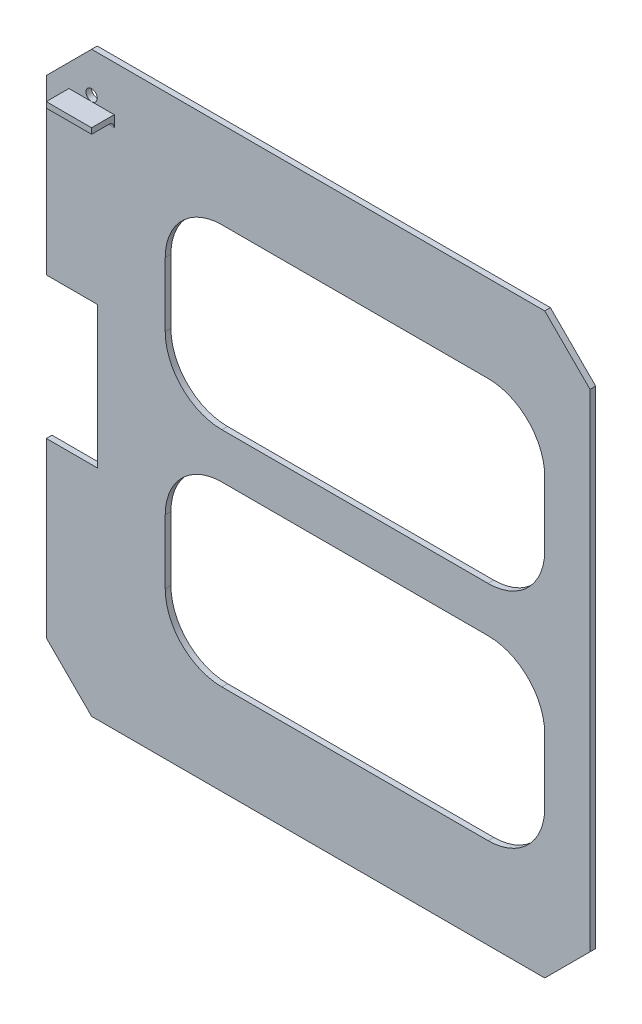
ISO-10303-21;
HEADER;
FILE_DESCRIPTION(('STEP AP214'),'2;1');
FILE_NAME('part.step','',(''),(''),'','','');
FILE_SCHEMA(('AUTOMOTIVE_DESIGN { 1 0 10303 214 1 1 1 1 }'));
ENDSEC;
DATA;
#1=APPLICATION_CONTEXT('core data for automotive mechanical design processes');
#2=APPLICATION_PROTOCOL_DEFINITION('international standard','automotive_design',2000,#1);
#3=PRODUCT_CONTEXT('',#1,'mechanical');
#4=PRODUCT('Part','Part','',(#3));
#5=PRODUCT_RELATED_PRODUCT_CATEGORY('part','',(#4));
#6=PRODUCT_DEFINITION_FORMATION('','',#4);
#7=PRODUCT_DEFINITION_CONTEXT('part definition',#1,'design');
#8=PRODUCT_DEFINITION('design','',#6,#7);
#9=PRODUCT_DEFINITION_SHAPE('','',#8);
#10=(LENGTH_UNIT() NAMED_UNIT(*) SI_UNIT(.MILLI.,.METRE.));
#11=(NAMED_UNIT(*) PLANE_ANGLE_UNIT() SI_UNIT($,.RADIAN.));
#12=(NAMED_UNIT(*) SI_UNIT($,.STERADIAN.) SOLID_ANGLE_UNIT());
#13=UNCERTAINTY_MEASURE_WITH_UNIT(LENGTH_MEASURE(1.E-05),#10,'distance_accuracy_value','');
#14=(GEOMETRIC_REPRESENTATION_CONTEXT(3) GLOBAL_UNCERTAINTY_ASSIGNED_CONTEXT((#13)) GLOBAL_UNIT_ASSIGNED_CONTEXT((#10,
#11,#12)) REPRESENTATION_CONTEXT('',''));
#15=CARTESIAN_POINT('',(0.,0.,0.));
#16=DIRECTION('',(0.,0.,1.));
#17=DIRECTION('',(1.,0.,0.));
#18=AXIS2_PLACEMENT_3D('',#15,#16,#17);
#19=CARTESIAN_POINT('',(0.,25.4,3.175));
#20=DIRECTION('',(1.,0.,0.));
#21=DIRECTION('',(0.,0.,-1.));
#22=AXIS2_PLACEMENT_3D('',#19,#20,#21);
#23=PLANE('',#22);
#24=DIRECTION('',(0.,-1.,0.));
#25=VECTOR('',#24,1.);
#26=CARTESIAN_POINT('',(0.,25.4,0.));
#27=LINE('',#26,#25);
#28=CARTESIAN_POINT('',(0.,298.45,0.));
#29=VERTEX_POINT('',#28);
#30=CARTESIAN_POINT('',(0.,201.6125,0.));
#31=VERTEX_POINT('',#30);
#32=EDGE_CURVE('E465',#29,#31,#27,.T.);
#33=ORIENTED_EDGE('',*,*,#32,.T.);
#34=DIRECTION('',(0.,0.,1.));
#35=VECTOR('',#34,1.);
#36=CARTESIAN_POINT('',(0.,201.6125,0.));
#37=LINE('',#36,#35);
#38=CARTESIAN_POINT('',(0.,201.6125,3.175));
#39=VERTEX_POINT('',#38);
#40=EDGE_CURVE('E430',#31,#39,#37,.T.);
#41=ORIENTED_EDGE('',*,*,#40,.T.);
#42=DIRECTION('',(0.,-1.,0.));
#43=VECTOR('',#42,1.);
#44=CARTESIAN_POINT('',(0.,25.4,3.175));
#45=LINE('',#44,#43);
#46=CARTESIAN_POINT('',(0.,298.45,3.175));
#47=VERTEX_POINT('',#46);
#48=EDGE_CURVE('E446',#47,#39,#45,.T.);
#49=ORIENTED_EDGE('',*,*,#48,.F.);
#50=DIRECTION('',(0.,0.,-1.));
#51=VECTOR('',#50,1.);
#52=CARTESIAN_POINT('',(0.,298.45,3.175));
#53=LINE('',#52,#51);
#54=EDGE_CURVE('E494',#47,#29,#53,.T.);
#55=ORIENTED_EDGE('',*,*,#54,.T.);
#56=EDGE_LOOP('',(#33,#41,#49,#55));
#57=FACE_BOUND('',#56,.T.);
#58=ADVANCED_FACE('F33',(#57),#23,.F.);
#59=CARTESIAN_POINT('',(25.4,323.85,3.175));
#60=DIRECTION('',(0.,-1.,0.));
#61=DIRECTION('',(0.,0.,-1.));
#62=AXIS2_PLACEMENT_3D('',#59,#60,#61);
#63=PLANE('',#62);
#64=DIRECTION('',(-1.,0.,0.));
#65=VECTOR('',#64,1.);
#66=CARTESIAN_POINT('',(25.4,323.85,0.));
#67=LINE('',#66,#65);
#68=CARTESIAN_POINT('',(279.4,323.85,0.));
#69=VERTEX_POINT('',#68);
#70=CARTESIAN_POINT('',(25.4,323.85,0.));
#71=VERTEX_POINT('',#70);
#72=EDGE_CURVE('E433',#69,#71,#67,.T.);
#73=ORIENTED_EDGE('',*,*,#72,.T.);
#74=DIRECTION('',(0.,0.,-1.));
#75=VECTOR('',#74,1.);
#76=CARTESIAN_POINT('',(25.4,323.85,3.175));
#77=LINE('',#76,#75);
#78=CARTESIAN_POINT('',(25.4,323.85,3.175));
#79=VERTEX_POINT('',#78);
#80=EDGE_CURVE('E497',#79,#71,#77,.T.);
#81=ORIENTED_EDGE('',*,*,#80,.F.);
#82=DIRECTION('',(-1.,0.,0.));
#83=VECTOR('',#82,1.);
#84=CARTESIAN_POINT('',(25.4,323.85,3.175));
#85=LINE('',#84,#83);
#86=CARTESIAN_POINT('',(279.4,323.85,3.175));
#87=VERTEX_POINT('',#86);
#88=EDGE_CURVE('E439',#87,#79,#85,.T.);
#89=ORIENTED_EDGE('',*,*,#88,.F.);
#90=DIRECTION('',(0.,0.,-1.));
#91=VECTOR('',#90,1.);
#92=CARTESIAN_POINT('',(279.4,323.85,3.175));
#93=LINE('',#92,#91);
#94=EDGE_CURVE('E459',#87,#69,#93,.T.);
#95=ORIENTED_EDGE('',*,*,#94,.T.);
#96=EDGE_LOOP('',(#73,#81,#89,#95));
#97=FACE_BOUND('',#96,.T.);
#98=ADVANCED_FACE('F541',(#97),#63,.F.);
#99=CARTESIAN_POINT('',(0.,298.45,3.175));
#100=DIRECTION('',(0.707106781186547,-0.707106781186548,0.));
#101=DIRECTION('',(0.707106781186548,0.707106781186547,0.));
#102=AXIS2_PLACEMENT_3D('',#99,#100,#101);
#103=PLANE('',#102);
#104=DIRECTION('',(-0.707106781186548,-0.707106781186547,0.));
#105=VECTOR('',#104,1.);
#106=CARTESIAN_POINT('',(0.,298.45,0.));
#107=LINE('',#106,#105);
#108=EDGE_CURVE('E462',#71,#29,#107,.T.);
#109=ORIENTED_EDGE('',*,*,#108,.T.);
#110=ORIENTED_EDGE('',*,*,#54,.F.);
#111=DIRECTION('',(-0.707106781186548,-0.707106781186547,0.));
#112=VECTOR('',#111,1.);
#113=CARTESIAN_POINT('',(0.,298.45,3.175));
#114=LINE('',#113,#112);
#115=EDGE_CURVE('E442',#79,#47,#114,.T.);
#116=ORIENTED_EDGE('',*,*,#115,.F.);
#117=ORIENTED_EDGE('',*,*,#80,.T.);
#118=EDGE_LOOP('',(#109,#110,#116,#117));
#119=FACE_BOUND('',#118,.T.);
#120=ADVANCED_FACE('F548',(#119),#103,.F.);
#121=CARTESIAN_POINT('',(0.,122.2375,3.175));
#122=VERTEX_POINT('',#121);
#123=CARTESIAN_POINT('',(0.,25.4,3.175));
#124=VERTEX_POINT('',#123);
#125=EDGE_CURVE('E445',#122,#124,#45,.T.);
#126=ORIENTED_EDGE('',*,*,#125,.F.);
#127=DIRECTION('',(0.,0.,1.));
#128=VECTOR('',#127,1.);
#129=CARTESIAN_POINT('',(0.,122.2375,0.));
#130=LINE('',#129,#128);
#131=CARTESIAN_POINT('',(0.,122.2375,0.));
#132=VERTEX_POINT('',#131);
#133=EDGE_CURVE('E423',#132,#122,#130,.T.);
#134=ORIENTED_EDGE('',*,*,#133,.F.);
#135=CARTESIAN_POINT('',(0.,25.4,0.));
#136=VERTEX_POINT('',#135);
#137=EDGE_CURVE('E464',#132,#136,#27,.T.);
#138=ORIENTED_EDGE('',*,*,#137,.T.);
#139=DIRECTION('',(0.,0.,-1.));
#140=VECTOR('',#139,1.);
#141=CARTESIAN_POINT('',(0.,25.4,3.175));
#142=LINE('',#141,#140);
#143=EDGE_CURVE('E491',#124,#136,#142,.T.);
#144=ORIENTED_EDGE('',*,*,#143,.F.);
#145=EDGE_LOOP('',(#126,#134,#138,#144));
#146=FACE_BOUND('',#145,.T.);
#147=ADVANCED_FACE('F544',(#146),#23,.F.);
#148=CARTESIAN_POINT('',(25.4,0.,3.175));
#149=DIRECTION('',(0.707106781186548,0.707106781186548,0.));
#150=DIRECTION('',(-0.707106781186548,0.707106781186548,0.));
#151=AXIS2_PLACEMENT_3D('',#148,#149,#150);
#152=PLANE('',#151);
#153=DIRECTION('',(0.707106781186547,-0.707106781186547,0.));
#154=VECTOR('',#153,1.);
#155=CARTESIAN_POINT('',(25.4,0.,0.));
#156=LINE('',#155,#154);
#157=CARTESIAN_POINT('',(25.4,0.,0.));
#158=VERTEX_POINT('',#157);
#159=EDGE_CURVE('E468',#136,#158,#156,.T.);
#160=ORIENTED_EDGE('',*,*,#159,.T.);
#161=DIRECTION('',(0.,0.,-1.));
#162=VECTOR('',#161,1.);
#163=CARTESIAN_POINT('',(25.4,0.,3.175));
#164=LINE('',#163,#162);
#165=CARTESIAN_POINT('',(25.4,0.,3.175));
#166=VERTEX_POINT('',#165);
#167=EDGE_CURVE('E488',#166,#158,#164,.T.);
#168=ORIENTED_EDGE('',*,*,#167,.F.);
#169=DIRECTION('',(0.707106781186547,-0.707106781186547,0.));
#170=VECTOR('',#169,1.);
#171=CARTESIAN_POINT('',(25.4,0.,3.175));
#172=LINE('',#171,#170);
#173=EDGE_CURVE('E449',#124,#166,#172,.T.);
#174=ORIENTED_EDGE('',*,*,#173,.F.);
#175=ORIENTED_EDGE('',*,*,#143,.T.);
#176=EDGE_LOOP('',(#160,#168,#174,#175));
#177=FACE_BOUND('',#176,.T.);
#178=ADVANCED_FACE('F553',(#177),#152,.F.);
#179=CARTESIAN_POINT('',(25.4,0.,3.175));
#180=DIRECTION('',(0.,1.,0.));
#181=DIRECTION('',(0.,0.,1.));
#182=AXIS2_PLACEMENT_3D('',#179,#180,#181);
#183=PLANE('',#182);
#184=DIRECTION('',(1.,0.,0.));
#185=VECTOR('',#184,1.);
#186=CARTESIAN_POINT('',(25.4,0.,0.));
#187=LINE('',#186,#185);
#188=CARTESIAN_POINT('',(279.4,0.,0.));
#189=VERTEX_POINT('',#188);
#190=EDGE_CURVE('E470',#158,#189,#187,.T.);
#191=ORIENTED_EDGE('',*,*,#190,.T.);
#192=DIRECTION('',(0.,0.,-1.));
#193=VECTOR('',#192,1.);
#194=CARTESIAN_POINT('',(279.4,0.,3.175));
#195=LINE('',#194,#193);
#196=CARTESIAN_POINT('',(279.4,0.,3.175));
#197=VERTEX_POINT('',#196);
#198=EDGE_CURVE('E485',#197,#189,#195,.T.);
#199=ORIENTED_EDGE('',*,*,#198,.F.);
#200=DIRECTION('',(1.,0.,0.));
#201=VECTOR('',#200,1.);
#202=CARTESIAN_POINT('',(25.4,0.,3.175));
#203=LINE('',#202,#201);
#204=EDGE_CURVE('E451',#166,#197,#203,.T.);
#205=ORIENTED_EDGE('',*,*,#204,.F.);
#206=ORIENTED_EDGE('',*,*,#167,.T.);
#207=EDGE_LOOP('',(#191,#199,#205,#206));
#208=FACE_BOUND('',#207,.T.);
#209=ADVANCED_FACE('F559',(#208),#183,.F.);
#210=CARTESIAN_POINT('',(279.4,0.,3.175));
#211=DIRECTION('',(-0.707106781186548,0.707106781186547,0.));
#212=DIRECTION('',(-0.707106781186547,-0.707106781186548,0.));
#213=AXIS2_PLACEMENT_3D('',#210,#211,#212);
#214=PLANE('',#213);
#215=DIRECTION('',(0.707106781186547,0.707106781186548,0.));
#216=VECTOR('',#215,1.);
#217=CARTESIAN_POINT('',(279.4,0.,0.));
#218=LINE('',#217,#216);
#219=CARTESIAN_POINT('',(304.8,25.4,0.));
#220=VERTEX_POINT('',#219);
#221=EDGE_CURVE('E472',#189,#220,#218,.T.);
#222=ORIENTED_EDGE('',*,*,#221,.T.);
#223=DIRECTION('',(0.,0.,-1.));
#224=VECTOR('',#223,1.);
#225=CARTESIAN_POINT('',(304.8,25.4,3.175));
#226=LINE('',#225,#224);
#227=CARTESIAN_POINT('',(304.8,25.4,3.175));
#228=VERTEX_POINT('',#227);
#229=EDGE_CURVE('E482',#228,#220,#226,.T.);
#230=ORIENTED_EDGE('',*,*,#229,.F.);
#231=DIRECTION('',(0.707106781186547,0.707106781186548,0.));
#232=VECTOR('',#231,1.);
#233=CARTESIAN_POINT('',(279.4,0.,3.175));
#234=LINE('',#233,#232);
#235=EDGE_CURVE('E453',#197,#228,#234,.T.);
#236=ORIENTED_EDGE('',*,*,#235,.F.);
#237=ORIENTED_EDGE('',*,*,#198,.T.);
#238=EDGE_LOOP('',(#222,#230,#236,#237));
#239=FACE_BOUND('',#238,.T.);
#240=ADVANCED_FACE('F587',(#239),#214,.F.);
#241=CARTESIAN_POINT('',(304.8,25.4,3.175));
#242=DIRECTION('',(-1.,0.,0.));
#243=DIRECTION('',(0.,0.,1.));
#244=AXIS2_PLACEMENT_3D('',#241,#242,#243);
#245=PLANE('',#244);
#246=DIRECTION('',(0.,1.,0.));
#247=VECTOR('',#246,1.);
#248=CARTESIAN_POINT('',(304.8,25.4,0.));
#249=LINE('',#248,#247);
#250=CARTESIAN_POINT('',(304.8,298.45,0.));
#251=VERTEX_POINT('',#250);
#252=EDGE_CURVE('E474',#220,#251,#249,.T.);
#253=ORIENTED_EDGE('',*,*,#252,.T.);
#254=DIRECTION('',(0.,0.,-1.));
#255=VECTOR('',#254,1.);
#256=CARTESIAN_POINT('',(304.8,298.45,3.175));
#257=LINE('',#256,#255);
#258=CARTESIAN_POINT('',(304.8,298.45,3.175));
#259=VERTEX_POINT('',#258);
#260=EDGE_CURVE('E479',#259,#251,#257,.T.);
#261=ORIENTED_EDGE('',*,*,#260,.F.);
#262=DIRECTION('',(0.,1.,0.));
#263=VECTOR('',#262,1.);
#264=CARTESIAN_POINT('',(304.8,25.4,3.175));
#265=LINE('',#264,#263);
#266=EDGE_CURVE('E455',#228,#259,#265,.T.);
#267=ORIENTED_EDGE('',*,*,#266,.F.);
#268=ORIENTED_EDGE('',*,*,#229,.T.);
#269=EDGE_LOOP('',(#253,#261,#267,#268));
#270=FACE_BOUND('',#269,.T.);
#271=ADVANCED_FACE('F591',(#270),#245,.F.);
#272=CARTESIAN_POINT('',(279.4,323.85,3.175));
#273=DIRECTION('',(-0.707106781186548,-0.707106781186548,0.));
#274=DIRECTION('',(0.707106781186548,-0.707106781186548,0.));
#275=AXIS2_PLACEMENT_3D('',#272,#273,#274);
#276=PLANE('',#275);
#277=DIRECTION('',(-0.707106781186547,0.707106781186547,0.));
#278=VECTOR('',#277,1.);
#279=CARTESIAN_POINT('',(279.4,323.85,0.));
#280=LINE('',#279,#278);
#281=EDGE_CURVE('E443',#251,#69,#280,.T.);
#282=ORIENTED_EDGE('',*,*,#281,.T.);
#283=ORIENTED_EDGE('',*,*,#94,.F.);
#284=DIRECTION('',(-0.707106781186547,0.707106781186547,0.));
#285=VECTOR('',#284,1.);
#286=CARTESIAN_POINT('',(279.4,323.85,3.175));
#287=LINE('',#286,#285);
#288=EDGE_CURVE('E457',#259,#87,#287,.T.);
#289=ORIENTED_EDGE('',*,*,#288,.F.);
#290=ORIENTED_EDGE('',*,*,#260,.T.);
#291=EDGE_LOOP('',(#282,#283,#289,#290));
#292=FACE_BOUND('',#291,.T.);
#293=ADVANCED_FACE('F596',(#292),#276,.F.);
#294=CARTESIAN_POINT('',(0.,0.,3.175));
#295=DIRECTION('',(0.,0.,1.));
#296=DIRECTION('',(1.,0.,0.));
#297=AXIS2_PLACEMENT_3D('',#294,#295,#296);
#298=PLANE('',#297);
#299=DIRECTION('',(0.,1.,0.));
#300=VECTOR('',#299,1.);
#301=CARTESIAN_POINT('',(38.1,298.45,3.175));
#302=LINE('',#301,#300);
#303=CARTESIAN_POINT('',(38.1,292.1,3.175));
#304=VERTEX_POINT('',#303);
#305=CARTESIAN_POINT('',(38.1,298.45,3.175));
#306=VERTEX_POINT('',#305);
#307=EDGE_CURVE('E48',#304,#306,#302,.T.);
#308=ORIENTED_EDGE('',*,*,#307,.F.);
#309=DIRECTION('',(1.,0.,0.));
#310=VECTOR('',#309,1.);
#311=CARTESIAN_POINT('',(0.,292.1,3.175));
#312=LINE('',#311,#310);
#313=CARTESIAN_POINT('',(12.7,292.1,3.175));
#314=VERTEX_POINT('',#313);
#315=EDGE_CURVE('E503',#304,#314,#312,.F.);
#316=ORIENTED_EDGE('',*,*,#315,.T.);
#317=DIRECTION('',(0.,-1.,0.));
#318=VECTOR('',#317,1.);
#319=CARTESIAN_POINT('',(12.7,298.45,3.175));
#320=LINE('',#319,#318);
#321=CARTESIAN_POINT('',(12.7,298.45,3.175));
#322=VERTEX_POINT('',#321);
#323=EDGE_CURVE('E55',#322,#314,#320,.T.);
#324=ORIENTED_EDGE('',*,*,#323,.F.);
#325=DIRECTION('',(-1.,0.,0.));
#326=VECTOR('',#325,1.);
#327=CARTESIAN_POINT('',(12.7,298.45,3.175));
#328=LINE('',#327,#326);
#329=CARTESIAN_POINT('',(25.4,298.45,3.175));
#330=VERTEX_POINT('',#329);
#331=EDGE_CURVE('E500',#330,#322,#328,.T.);
#332=ORIENTED_EDGE('',*,*,#331,.F.);
#333=CARTESIAN_POINT('',(25.4,301.625,3.175));
#334=DIRECTION('',(0.,0.,1.));
#335=DIRECTION('',(1.,0.,0.));
#336=AXIS2_PLACEMENT_3D('',#333,#334,#335);
#337=CIRCLE('',#336,3.17499999999998);
#338=EDGE_CURVE('E273',#330,#330,#337,.T.);
#339=ORIENTED_EDGE('',*,*,#338,.F.);
#340=EDGE_CURVE('E269',#306,#330,#328,.T.);
#341=ORIENTED_EDGE('',*,*,#340,.F.);
#342=EDGE_LOOP('',(#308,#316,#324,#332,#339,#341));
#343=FACE_BOUND('',#342,.T.);
#344=CARTESIAN_POINT('',(98.425,207.424891659339,3.175));
#345=DIRECTION('',(0.,0.,1.));
#346=DIRECTION('',(-1.,0.,0.));
#347=AXIS2_PLACEMENT_3D('',#344,#345,#346);
#348=CIRCLE('',#347,31.75);
#349=CARTESIAN_POINT('',(66.675,207.424891659339,3.175));
#350=VERTEX_POINT('',#349);
#351=CARTESIAN_POINT('',(98.4250000000002,175.674891659339,3.175));
#352=VERTEX_POINT('',#351);
#353=EDGE_CURVE('E283',#350,#352,#348,.T.);
#354=ORIENTED_EDGE('',*,*,#353,.F.);
#355=DIRECTION('',(0.,-1.,0.));
#356=VECTOR('',#355,1.);
#357=CARTESIAN_POINT('',(66.675,243.399783318678,3.175));
#358=LINE('',#357,#356);
#359=CARTESIAN_POINT('',(66.675,243.399783318678,3.175));
#360=VERTEX_POINT('',#359);
#361=EDGE_CURVE('E289',#360,#350,#358,.T.);
#362=ORIENTED_EDGE('',*,*,#361,.F.);
#363=CARTESIAN_POINT('',(98.425,243.399783318679,3.175));
#364=DIRECTION('',(0.,0.,1.));
#365=DIRECTION('',(-1.,0.,0.));
#366=AXIS2_PLACEMENT_3D('',#363,#364,#365);
#367=CIRCLE('',#366,31.75);
#368=CARTESIAN_POINT('',(98.4250000000002,275.149783318678,3.175));
#369=VERTEX_POINT('',#368);
#370=EDGE_CURVE('E327',#369,#360,#367,.T.);
#371=ORIENTED_EDGE('',*,*,#370,.F.);
#372=DIRECTION('',(-1.,0.,0.));
#373=VECTOR('',#372,1.);
#374=CARTESIAN_POINT('',(98.4250000000002,275.149783318678,3.175));
#375=LINE('',#374,#373);
#376=CARTESIAN_POINT('',(247.65,275.149783318678,3.175));
#377=VERTEX_POINT('',#376);
#378=EDGE_CURVE('E324',#377,#369,#375,.T.);
#379=ORIENTED_EDGE('',*,*,#378,.F.);
#380=CARTESIAN_POINT('',(247.65,243.399783318679,3.175));
#381=DIRECTION('',(0.,0.,1.));
#382=DIRECTION('',(1.,0.,0.));
#383=AXIS2_PLACEMENT_3D('',#380,#381,#382);
#384=CIRCLE('',#383,31.75);
#385=CARTESIAN_POINT('',(279.4,243.399783318678,3.175));
#386=VERTEX_POINT('',#385);
#387=EDGE_CURVE('E321',#386,#377,#384,.T.);
#388=ORIENTED_EDGE('',*,*,#387,.F.);
#389=DIRECTION('',(0.,1.,0.));
#390=VECTOR('',#389,1.);
#391=CARTESIAN_POINT('',(279.4,243.399783318678,3.175));
#392=LINE('',#391,#390);
#393=CARTESIAN_POINT('',(279.4,207.424891659339,3.175));
#394=VERTEX_POINT('',#393);
#395=EDGE_CURVE('E318',#394,#386,#392,.T.);
#396=ORIENTED_EDGE('',*,*,#395,.F.);
#397=CARTESIAN_POINT('',(247.65,207.424891659339,3.175));
#398=DIRECTION('',(0.,0.,1.));
#399=DIRECTION('',(-1.,0.,0.));
#400=AXIS2_PLACEMENT_3D('',#397,#398,#399);
#401=CIRCLE('',#400,31.75);
#402=CARTESIAN_POINT('',(247.65,175.674891659339,3.175));
#403=VERTEX_POINT('',#402);
#404=EDGE_CURVE('E315',#403,#394,#401,.T.);
#405=ORIENTED_EDGE('',*,*,#404,.F.);
#406=DIRECTION('',(1.,0.,0.));
#407=VECTOR('',#406,1.);
#408=CARTESIAN_POINT('',(98.4250000000002,175.674891659339,3.175));
#409=LINE('',#408,#407);
#410=EDGE_CURVE('E312',#352,#403,#409,.T.);
#411=ORIENTED_EDGE('',*,*,#410,.F.);
#412=EDGE_LOOP('',(#354,#362,#371,#379,#388,#396,#405,#411));
#413=FACE_BOUND('',#412,.T.);
#414=CARTESIAN_POINT('',(98.425,82.55,3.175));
#415=DIRECTION('',(0.,0.,1.));
#416=DIRECTION('',(-1.,0.,0.));
#417=AXIS2_PLACEMENT_3D('',#414,#415,#416);
#418=CIRCLE('',#417,31.75);
#419=CARTESIAN_POINT('',(66.675,82.5500000000002,3.175));
#420=VERTEX_POINT('',#419);
#421=CARTESIAN_POINT('',(98.4250000000002,50.8,3.175));
#422=VERTEX_POINT('',#421);
#423=EDGE_CURVE('E334',#420,#422,#418,.T.);
#424=ORIENTED_EDGE('',*,*,#423,.F.);
#425=DIRECTION('',(0.,-1.,0.));
#426=VECTOR('',#425,1.);
#427=CARTESIAN_POINT('',(66.675,118.524891659339,3.175));
#428=LINE('',#427,#426);
#429=CARTESIAN_POINT('',(66.675,118.524891659339,3.175));
#430=VERTEX_POINT('',#429);
#431=EDGE_CURVE('E353',#430,#420,#428,.T.);
#432=ORIENTED_EDGE('',*,*,#431,.F.);
#433=CARTESIAN_POINT('',(98.425,118.524891659339,3.175));
#434=DIRECTION('',(0.,0.,1.));
#435=DIRECTION('',(-1.,0.,0.));
#436=AXIS2_PLACEMENT_3D('',#433,#434,#435);
#437=CIRCLE('',#436,31.75);
#438=CARTESIAN_POINT('',(98.4250000000003,150.274891659339,3.175));
#439=VERTEX_POINT('',#438);
#440=EDGE_CURVE('E391',#439,#430,#437,.T.);
#441=ORIENTED_EDGE('',*,*,#440,.F.);
#442=DIRECTION('',(-1.,0.,0.));
#443=VECTOR('',#442,1.);
#444=CARTESIAN_POINT('',(98.4250000000003,150.274891659339,3.175));
#445=LINE('',#444,#443);
#446=CARTESIAN_POINT('',(247.65,150.274891659339,3.175));
#447=VERTEX_POINT('',#446);
#448=EDGE_CURVE('E388',#447,#439,#445,.T.);
#449=ORIENTED_EDGE('',*,*,#448,.F.);
#450=CARTESIAN_POINT('',(247.65,118.524891659339,3.175));
#451=DIRECTION('',(0.,0.,1.));
#452=DIRECTION('',(1.,0.,0.));
#453=AXIS2_PLACEMENT_3D('',#450,#451,#452);
#454=CIRCLE('',#453,31.75);
#455=CARTESIAN_POINT('',(279.4,118.524891659339,3.175));
#456=VERTEX_POINT('',#455);
#457=EDGE_CURVE('E385',#456,#447,#454,.T.);
#458=ORIENTED_EDGE('',*,*,#457,.F.);
#459=DIRECTION('',(0.,1.,0.));
#460=VECTOR('',#459,1.);
#461=CARTESIAN_POINT('',(279.4,118.524891659339,3.175));
#462=LINE('',#461,#460);
#463=CARTESIAN_POINT('',(279.4,82.5500000000002,3.175));
#464=VERTEX_POINT('',#463);
#465=EDGE_CURVE('E382',#464,#456,#462,.T.);
#466=ORIENTED_EDGE('',*,*,#465,.F.);
#467=CARTESIAN_POINT('',(247.65,82.55,3.175));
#468=DIRECTION('',(0.,0.,1.));
#469=DIRECTION('',(1.,0.,0.));
#470=AXIS2_PLACEMENT_3D('',#467,#468,#469);
#471=CIRCLE('',#470,31.75);
#472=CARTESIAN_POINT('',(247.65,50.8,3.175));
#473=VERTEX_POINT('',#472);
#474=EDGE_CURVE('E379',#473,#464,#471,.T.);
#475=ORIENTED_EDGE('',*,*,#474,.F.);
#476=DIRECTION('',(1.,0.,0.));
#477=VECTOR('',#476,1.);
#478=CARTESIAN_POINT('',(98.4250000000002,50.8,3.175));
#479=LINE('',#478,#477);
#480=EDGE_CURVE('E376',#422,#473,#479,.T.);
#481=ORIENTED_EDGE('',*,*,#480,.F.);
#482=EDGE_LOOP('',(#424,#432,#441,#449,#458,#466,#475,#481));
#483=FACE_BOUND('',#482,.T.);
#484=DIRECTION('',(-1.,0.,0.));
#485=VECTOR('',#484,1.);
#486=CARTESIAN_POINT('',(0.,201.6125,3.175));
#487=LINE('',#486,#485);
#488=CARTESIAN_POINT('',(28.575,201.6125,3.175));
#489=VERTEX_POINT('',#488);
#490=EDGE_CURVE('E417',#489,#39,#487,.T.);
#491=ORIENTED_EDGE('',*,*,#490,.F.);
#492=DIRECTION('',(0.,1.,0.));
#493=VECTOR('',#492,1.);
#494=CARTESIAN_POINT('',(28.575,201.6125,3.175));
#495=LINE('',#494,#493);
#496=CARTESIAN_POINT('',(28.575,122.2375,3.175));
#497=VERTEX_POINT('',#496);
#498=EDGE_CURVE('E426',#497,#489,#495,.T.);
#499=ORIENTED_EDGE('',*,*,#498,.F.);
#500=DIRECTION('',(1.,0.,0.));
#501=VECTOR('',#500,1.);
#502=CARTESIAN_POINT('',(0.,122.2375,3.175));
#503=LINE('',#502,#501);
#504=EDGE_CURVE('E398',#122,#497,#503,.T.);
#505=ORIENTED_EDGE('',*,*,#504,.F.);
#506=ORIENTED_EDGE('',*,*,#125,.T.);
#507=ORIENTED_EDGE('',*,*,#173,.T.);
#508=ORIENTED_EDGE('',*,*,#204,.T.);
#509=ORIENTED_EDGE('',*,*,#235,.T.);
#510=ORIENTED_EDGE('',*,*,#266,.T.);
#511=ORIENTED_EDGE('',*,*,#288,.T.);
#512=ORIENTED_EDGE('',*,*,#88,.T.);
#513=ORIENTED_EDGE('',*,*,#115,.T.);
#514=ORIENTED_EDGE('',*,*,#48,.T.);
#515=EDGE_LOOP('',(#491,#499,#505,#506,#507,#508,#509,#510,#511,#512,#513,#514));
#516=FACE_BOUND('',#515,.T.);
#517=ADVANCED_FACE('F510',(#343,#413,#483,#516),#298,.T.);
#518=CARTESIAN_POINT('',(0.,0.,0.));
#519=DIRECTION('',(0.,0.,1.));
#520=DIRECTION('',(1.,0.,0.));
#521=AXIS2_PLACEMENT_3D('',#518,#519,#520);
#522=PLANE('',#521);
#523=CARTESIAN_POINT('',(25.4,301.625,0.));
#524=DIRECTION('',(0.,0.,1.));
#525=DIRECTION('',(1.,0.,0.));
#526=AXIS2_PLACEMENT_3D('',#523,#524,#525);
#527=CIRCLE('',#526,3.17499999999998);
#528=CARTESIAN_POINT('',(28.575,301.625,0.));
#529=VERTEX_POINT('',#528);
#530=EDGE_CURVE('E276',#529,#529,#527,.T.);
#531=ORIENTED_EDGE('',*,*,#530,.T.);
#532=EDGE_LOOP('',(#531));
#533=FACE_BOUND('',#532,.T.);
#534=DIRECTION('',(0.,-1.,0.));
#535=VECTOR('',#534,1.);
#536=CARTESIAN_POINT('',(66.675,243.399783318678,0.));
#537=LINE('',#536,#535);
#538=CARTESIAN_POINT('',(66.675,243.399783318678,0.));
#539=VERTEX_POINT('',#538);
#540=CARTESIAN_POINT('',(66.675,207.424891659339,0.));
#541=VERTEX_POINT('',#540);
#542=EDGE_CURVE('E307',#539,#541,#537,.T.);
#543=ORIENTED_EDGE('',*,*,#542,.T.);
#544=CARTESIAN_POINT('',(98.425,207.424891659339,0.));
#545=DIRECTION('',(0.,0.,1.));
#546=DIRECTION('',(-1.,0.,0.));
#547=AXIS2_PLACEMENT_3D('',#544,#545,#546);
#548=CIRCLE('',#547,31.75);
#549=CARTESIAN_POINT('',(98.4250000000002,175.674891659339,0.));
#550=VERTEX_POINT('',#549);
#551=EDGE_CURVE('E285',#541,#550,#548,.T.);
#552=ORIENTED_EDGE('',*,*,#551,.T.);
#553=DIRECTION('',(1.,0.,0.));
#554=VECTOR('',#553,1.);
#555=CARTESIAN_POINT('',(98.4250000000002,175.674891659339,0.));
#556=LINE('',#555,#554);
#557=CARTESIAN_POINT('',(247.65,175.674891659339,0.));
#558=VERTEX_POINT('',#557);
#559=EDGE_CURVE('E288',#550,#558,#556,.T.);
#560=ORIENTED_EDGE('',*,*,#559,.T.);
#561=CARTESIAN_POINT('',(247.65,207.424891659339,0.));
#562=DIRECTION('',(0.,0.,1.));
#563=DIRECTION('',(-1.,0.,0.));
#564=AXIS2_PLACEMENT_3D('',#561,#562,#563);
#565=CIRCLE('',#564,31.75);
#566=CARTESIAN_POINT('',(279.4,207.424891659339,0.));
#567=VERTEX_POINT('',#566);
#568=EDGE_CURVE('E292',#558,#567,#565,.T.);
#569=ORIENTED_EDGE('',*,*,#568,.T.);
#570=DIRECTION('',(0.,1.,0.));
#571=VECTOR('',#570,1.);
#572=CARTESIAN_POINT('',(279.4,243.399783318678,0.));
#573=LINE('',#572,#571);
#574=CARTESIAN_POINT('',(279.4,243.399783318678,0.));
#575=VERTEX_POINT('',#574);
#576=EDGE_CURVE('E295',#567,#575,#573,.T.);
#577=ORIENTED_EDGE('',*,*,#576,.T.);
#578=CARTESIAN_POINT('',(247.65,243.399783318679,0.));
#579=DIRECTION('',(0.,0.,1.));
#580=DIRECTION('',(1.,0.,0.));
#581=AXIS2_PLACEMENT_3D('',#578,#579,#580);
#582=CIRCLE('',#581,31.75);
#583=CARTESIAN_POINT('',(247.65,275.149783318678,0.));
#584=VERTEX_POINT('',#583);
#585=EDGE_CURVE('E298',#575,#584,#582,.T.);
#586=ORIENTED_EDGE('',*,*,#585,.T.);
#587=DIRECTION('',(-1.,0.,0.));
#588=VECTOR('',#587,1.);
#589=CARTESIAN_POINT('',(98.4250000000002,275.149783318678,0.));
#590=LINE('',#589,#588);
#591=CARTESIAN_POINT('',(98.4250000000002,275.149783318678,0.));
#592=VERTEX_POINT('',#591);
#593=EDGE_CURVE('E301',#584,#592,#590,.T.);
#594=ORIENTED_EDGE('',*,*,#593,.T.);
#595=CARTESIAN_POINT('',(98.425,243.399783318679,0.));
#596=DIRECTION('',(0.,0.,1.));
#597=DIRECTION('',(-1.,0.,0.));
#598=AXIS2_PLACEMENT_3D('',#595,#596,#597);
#599=CIRCLE('',#598,31.75);
#600=EDGE_CURVE('E304',#592,#539,#599,.T.);
#601=ORIENTED_EDGE('',*,*,#600,.T.);
#602=EDGE_LOOP('',(#543,#552,#560,#569,#577,#586,#594,#601));
#603=FACE_BOUND('',#602,.T.);
#604=DIRECTION('',(0.,-1.,0.));
#605=VECTOR('',#604,1.);
#606=CARTESIAN_POINT('',(66.675,118.524891659339,0.));
#607=LINE('',#606,#605);
#608=CARTESIAN_POINT('',(66.675,118.524891659339,0.));
#609=VERTEX_POINT('',#608);
#610=CARTESIAN_POINT('',(66.675,82.5500000000002,0.));
#611=VERTEX_POINT('',#610);
#612=EDGE_CURVE('E371',#609,#611,#607,.T.);
#613=ORIENTED_EDGE('',*,*,#612,.T.);
#614=CARTESIAN_POINT('',(98.425,82.55,0.));
#615=DIRECTION('',(0.,0.,1.));
#616=DIRECTION('',(-1.,0.,0.));
#617=AXIS2_PLACEMENT_3D('',#614,#615,#616);
#618=CIRCLE('',#617,31.75);
#619=CARTESIAN_POINT('',(98.4250000000002,50.8,0.));
#620=VERTEX_POINT('',#619);
#621=EDGE_CURVE('E349',#611,#620,#618,.T.);
#622=ORIENTED_EDGE('',*,*,#621,.T.);
#623=DIRECTION('',(1.,0.,0.));
#624=VECTOR('',#623,1.);
#625=CARTESIAN_POINT('',(98.4250000000002,50.8,0.));
#626=LINE('',#625,#624);
#627=CARTESIAN_POINT('',(247.65,50.8,0.));
#628=VERTEX_POINT('',#627);
#629=EDGE_CURVE('E352',#620,#628,#626,.T.);
#630=ORIENTED_EDGE('',*,*,#629,.T.);
#631=CARTESIAN_POINT('',(247.65,82.55,0.));
#632=DIRECTION('',(0.,0.,1.));
#633=DIRECTION('',(1.,0.,0.));
#634=AXIS2_PLACEMENT_3D('',#631,#632,#633);
#635=CIRCLE('',#634,31.75);
#636=CARTESIAN_POINT('',(279.4,82.5500000000002,0.));
#637=VERTEX_POINT('',#636);
#638=EDGE_CURVE('E356',#628,#637,#635,.T.);
#639=ORIENTED_EDGE('',*,*,#638,.T.);
#640=DIRECTION('',(0.,1.,0.));
#641=VECTOR('',#640,1.);
#642=CARTESIAN_POINT('',(279.4,118.524891659339,0.));
#643=LINE('',#642,#641);
#644=CARTESIAN_POINT('',(279.4,118.524891659339,0.));
#645=VERTEX_POINT('',#644);
#646=EDGE_CURVE('E359',#637,#645,#643,.T.);
#647=ORIENTED_EDGE('',*,*,#646,.T.);
#648=CARTESIAN_POINT('',(247.65,118.524891659339,0.));
#649=DIRECTION('',(0.,0.,1.));
#650=DIRECTION('',(1.,0.,0.));
#651=AXIS2_PLACEMENT_3D('',#648,#649,#650);
#652=CIRCLE('',#651,31.75);
#653=CARTESIAN_POINT('',(247.65,150.274891659339,0.));
#654=VERTEX_POINT('',#653);
#655=EDGE_CURVE('E362',#645,#654,#652,.T.);
#656=ORIENTED_EDGE('',*,*,#655,.T.);
#657=DIRECTION('',(-1.,0.,0.));
#658=VECTOR('',#657,1.);
#659=CARTESIAN_POINT('',(98.4250000000003,150.274891659339,0.));
#660=LINE('',#659,#658);
#661=CARTESIAN_POINT('',(98.4250000000003,150.274891659339,0.));
#662=VERTEX_POINT('',#661);
#663=EDGE_CURVE('E365',#654,#662,#660,.T.);
#664=ORIENTED_EDGE('',*,*,#663,.T.);
#665=CARTESIAN_POINT('',(98.425,118.524891659339,0.));
#666=DIRECTION('',(0.,0.,1.));
#667=DIRECTION('',(-1.,0.,0.));
#668=AXIS2_PLACEMENT_3D('',#665,#666,#667);
#669=CIRCLE('',#668,31.75);
#670=EDGE_CURVE('E368',#662,#609,#669,.T.);
#671=ORIENTED_EDGE('',*,*,#670,.T.);
#672=EDGE_LOOP('',(#613,#622,#630,#639,#647,#656,#664,#671));
#673=FACE_BOUND('',#672,.T.);
#674=DIRECTION('',(0.,1.,0.));
#675=VECTOR('',#674,1.);
#676=CARTESIAN_POINT('',(28.575,201.6125,0.));
#677=LINE('',#676,#675);
#678=CARTESIAN_POINT('',(28.575,122.2375,0.));
#679=VERTEX_POINT('',#678);
#680=CARTESIAN_POINT('',(28.575,201.6125,0.));
#681=VERTEX_POINT('',#680);
#682=EDGE_CURVE('E416',#679,#681,#677,.T.);
#683=ORIENTED_EDGE('',*,*,#682,.T.);
#684=DIRECTION('',(-1.,0.,0.));
#685=VECTOR('',#684,1.);
#686=CARTESIAN_POINT('',(0.,201.6125,0.));
#687=LINE('',#686,#685);
#688=EDGE_CURVE('E420',#681,#31,#687,.T.);
#689=ORIENTED_EDGE('',*,*,#688,.T.);
#690=ORIENTED_EDGE('',*,*,#32,.F.);
#691=ORIENTED_EDGE('',*,*,#108,.F.);
#692=ORIENTED_EDGE('',*,*,#72,.F.);
#693=ORIENTED_EDGE('',*,*,#281,.F.);
#694=ORIENTED_EDGE('',*,*,#252,.F.);
#695=ORIENTED_EDGE('',*,*,#221,.F.);
#696=ORIENTED_EDGE('',*,*,#190,.F.);
#697=ORIENTED_EDGE('',*,*,#159,.F.);
#698=ORIENTED_EDGE('',*,*,#137,.F.);
#699=DIRECTION('',(1.,0.,0.));
#700=VECTOR('',#699,1.);
#701=CARTESIAN_POINT('',(0.,122.2375,0.));
#702=LINE('',#701,#700);
#703=EDGE_CURVE('E413',#132,#679,#702,.T.);
#704=ORIENTED_EDGE('',*,*,#703,.T.);
#705=EDGE_LOOP('',(#683,#689,#690,#691,#692,#693,#694,#695,#696,#697,#698,#704));
#706=FACE_BOUND('',#705,.T.);
#707=ADVANCED_FACE('F576',(#533,#603,#673,#706),#522,.F.);
#708=CARTESIAN_POINT('',(0.,201.6125,0.));
#709=DIRECTION('',(0.,1.,0.));
#710=DIRECTION('',(0.,0.,1.));
#711=AXIS2_PLACEMENT_3D('',#708,#709,#710);
#712=PLANE('',#711);
#713=ORIENTED_EDGE('',*,*,#490,.T.);
#714=ORIENTED_EDGE('',*,*,#40,.F.);
#715=ORIENTED_EDGE('',*,*,#688,.F.);
#716=DIRECTION('',(0.,0.,1.));
#717=VECTOR('',#716,1.);
#718=CARTESIAN_POINT('',(28.575,201.6125,0.));
#719=LINE('',#718,#717);
#720=EDGE_CURVE('E434',#681,#489,#719,.T.);
#721=ORIENTED_EDGE('',*,*,#720,.T.);
#722=EDGE_LOOP('',(#713,#714,#715,#721));
#723=FACE_BOUND('',#722,.T.);
#724=ADVANCED_FACE('F604',(#723),#712,.F.);
#725=CARTESIAN_POINT('',(28.575,201.6125,0.));
#726=DIRECTION('',(1.,0.,0.));
#727=DIRECTION('',(0.,1.,0.));
#728=AXIS2_PLACEMENT_3D('',#725,#726,#727);
#729=PLANE('',#728);
#730=ORIENTED_EDGE('',*,*,#498,.T.);
#731=ORIENTED_EDGE('',*,*,#720,.F.);
#732=ORIENTED_EDGE('',*,*,#682,.F.);
#733=DIRECTION('',(0.,0.,1.));
#734=VECTOR('',#733,1.);
#735=CARTESIAN_POINT('',(28.575,122.2375,0.));
#736=LINE('',#735,#734);
#737=EDGE_CURVE('E436',#679,#497,#736,.T.);
#738=ORIENTED_EDGE('',*,*,#737,.T.);
#739=EDGE_LOOP('',(#730,#731,#732,#738));
#740=FACE_BOUND('',#739,.T.);
#741=ADVANCED_FACE('F607',(#740),#729,.F.);
#742=CARTESIAN_POINT('',(0.,122.2375,0.));
#743=DIRECTION('',(0.,-1.,0.));
#744=DIRECTION('',(0.,0.,-1.));
#745=AXIS2_PLACEMENT_3D('',#742,#743,#744);
#746=PLANE('',#745);
#747=ORIENTED_EDGE('',*,*,#504,.T.);
#748=ORIENTED_EDGE('',*,*,#737,.F.);
#749=ORIENTED_EDGE('',*,*,#703,.F.);
#750=ORIENTED_EDGE('',*,*,#133,.T.);
#751=EDGE_LOOP('',(#747,#748,#749,#750));
#752=FACE_BOUND('',#751,.T.);
#753=ADVANCED_FACE('F574',(#752),#746,.F.);
#754=CARTESIAN_POINT('',(98.425,82.55,0.));
#755=DIRECTION('',(0.,0.,1.));
#756=DIRECTION('',(1.,0.,0.));
#757=AXIS2_PLACEMENT_3D('',#754,#755,#756);
#758=CYLINDRICAL_SURFACE('',#757,31.75);
#759=ORIENTED_EDGE('',*,*,#423,.T.);
#760=DIRECTION('',(0.,0.,1.));
#761=VECTOR('',#760,1.);
#762=CARTESIAN_POINT('',(98.4250000000002,50.8,0.));
#763=LINE('',#762,#761);
#764=EDGE_CURVE('E374',#620,#422,#763,.T.);
#765=ORIENTED_EDGE('',*,*,#764,.F.);
#766=ORIENTED_EDGE('',*,*,#621,.F.);
#767=DIRECTION('',(0.,0.,1.));
#768=VECTOR('',#767,1.);
#769=CARTESIAN_POINT('',(66.675,82.5500000000002,0.));
#770=LINE('',#769,#768);
#771=EDGE_CURVE('E396',#611,#420,#770,.T.);
#772=ORIENTED_EDGE('',*,*,#771,.T.);
#773=EDGE_LOOP('',(#759,#765,#766,#772));
#774=FACE_BOUND('',#773,.T.);
#775=ADVANCED_FACE('F614',(#774),#758,.F.);
#776=CARTESIAN_POINT('',(66.675,118.524891659339,0.));
#777=DIRECTION('',(-1.,0.,0.));
#778=DIRECTION('',(0.,-1.,0.));
#779=AXIS2_PLACEMENT_3D('',#776,#777,#778);
#780=PLANE('',#779);
#781=ORIENTED_EDGE('',*,*,#431,.T.);
#782=ORIENTED_EDGE('',*,*,#771,.F.);
#783=ORIENTED_EDGE('',*,*,#612,.F.);
#784=DIRECTION('',(0.,0.,1.));
#785=VECTOR('',#784,1.);
#786=CARTESIAN_POINT('',(66.675,118.524891659339,0.));
#787=LINE('',#786,#785);
#788=EDGE_CURVE('E399',#609,#430,#787,.T.);
#789=ORIENTED_EDGE('',*,*,#788,.T.);
#790=EDGE_LOOP('',(#781,#782,#783,#789));
#791=FACE_BOUND('',#790,.T.);
#792=ADVANCED_FACE('F684',(#791),#780,.F.);
#793=CARTESIAN_POINT('',(98.425,118.524891659339,0.));
#794=DIRECTION('',(0.,0.,1.));
#795=DIRECTION('',(1.,0.,0.));
#796=AXIS2_PLACEMENT_3D('',#793,#794,#795);
#797=CYLINDRICAL_SURFACE('',#796,31.75);
#798=ORIENTED_EDGE('',*,*,#440,.T.);
#799=ORIENTED_EDGE('',*,*,#788,.F.);
#800=ORIENTED_EDGE('',*,*,#670,.F.);
#801=DIRECTION('',(0.,0.,1.));
#802=VECTOR('',#801,1.);
#803=CARTESIAN_POINT('',(98.4250000000003,150.274891659339,0.));
#804=LINE('',#803,#802);
#805=EDGE_CURVE('E401',#662,#439,#804,.T.);
#806=ORIENTED_EDGE('',*,*,#805,.T.);
#807=EDGE_LOOP('',(#798,#799,#800,#806));
#808=FACE_BOUND('',#807,.T.);
#809=ADVANCED_FACE('F693',(#808),#797,.F.);
#810=CARTESIAN_POINT('',(98.4250000000003,150.274891659339,0.));
#811=DIRECTION('',(0.,1.,0.));
#812=DIRECTION('',(0.,0.,1.));
#813=AXIS2_PLACEMENT_3D('',#810,#811,#812);
#814=PLANE('',#813);
#815=ORIENTED_EDGE('',*,*,#448,.T.);
#816=ORIENTED_EDGE('',*,*,#805,.F.);
#817=ORIENTED_EDGE('',*,*,#663,.F.);
#818=DIRECTION('',(0.,0.,1.));
#819=VECTOR('',#818,1.);
#820=CARTESIAN_POINT('',(247.65,150.274891659339,0.));
#821=LINE('',#820,#819);
#822=EDGE_CURVE('E403',#654,#447,#821,.T.);
#823=ORIENTED_EDGE('',*,*,#822,.T.);
#824=EDGE_LOOP('',(#815,#816,#817,#823));
#825=FACE_BOUND('',#824,.T.);
#826=ADVANCED_FACE('F703',(#825),#814,.F.);
#827=CARTESIAN_POINT('',(247.65,118.524891659339,0.));
#828=DIRECTION('',(0.,0.,1.));
#829=DIRECTION('',(1.,0.,0.));
#830=AXIS2_PLACEMENT_3D('',#827,#828,#829);
#831=CYLINDRICAL_SURFACE('',#830,31.75);
#832=ORIENTED_EDGE('',*,*,#457,.T.);
#833=ORIENTED_EDGE('',*,*,#822,.F.);
#834=ORIENTED_EDGE('',*,*,#655,.F.);
#835=DIRECTION('',(0.,0.,1.));
#836=VECTOR('',#835,1.);
#837=CARTESIAN_POINT('',(279.4,118.524891659339,0.));
#838=LINE('',#837,#836);
#839=EDGE_CURVE('E405',#645,#456,#838,.T.);
#840=ORIENTED_EDGE('',*,*,#839,.T.);
#841=EDGE_LOOP('',(#832,#833,#834,#840));
#842=FACE_BOUND('',#841,.T.);
#843=ADVANCED_FACE('F713',(#842),#831,.F.);
#844=CARTESIAN_POINT('',(279.4,118.524891659339,0.));
#845=DIRECTION('',(1.,0.,0.));
#846=DIRECTION('',(0.,0.,-1.));
#847=AXIS2_PLACEMENT_3D('',#844,#845,#846);
#848=PLANE('',#847);
#849=ORIENTED_EDGE('',*,*,#465,.T.);
#850=ORIENTED_EDGE('',*,*,#839,.F.);
#851=ORIENTED_EDGE('',*,*,#646,.F.);
#852=DIRECTION('',(0.,0.,1.));
#853=VECTOR('',#852,1.);
#854=CARTESIAN_POINT('',(279.4,82.5500000000002,0.));
#855=LINE('',#854,#853);
#856=EDGE_CURVE('E407',#637,#464,#855,.T.);
#857=ORIENTED_EDGE('',*,*,#856,.T.);
#858=EDGE_LOOP('',(#849,#850,#851,#857));
#859=FACE_BOUND('',#858,.T.);
#860=ADVANCED_FACE('F723',(#859),#848,.F.);
#861=CARTESIAN_POINT('',(247.65,82.55,0.));
#862=DIRECTION('',(0.,0.,1.));
#863=DIRECTION('',(1.,0.,0.));
#864=AXIS2_PLACEMENT_3D('',#861,#862,#863);
#865=CYLINDRICAL_SURFACE('',#864,31.75);
#866=ORIENTED_EDGE('',*,*,#474,.T.);
#867=ORIENTED_EDGE('',*,*,#856,.F.);
#868=ORIENTED_EDGE('',*,*,#638,.F.);
#869=DIRECTION('',(0.,0.,1.));
#870=VECTOR('',#869,1.);
#871=CARTESIAN_POINT('',(247.65,50.8,0.));
#872=LINE('',#871,#870);
#873=EDGE_CURVE('E409',#628,#473,#872,.T.);
#874=ORIENTED_EDGE('',*,*,#873,.T.);
#875=EDGE_LOOP('',(#866,#867,#868,#874));
#876=FACE_BOUND('',#875,.T.);
#877=ADVANCED_FACE('F733',(#876),#865,.F.);
#878=CARTESIAN_POINT('',(98.4250000000002,50.8,0.));
#879=DIRECTION('',(0.,-1.,0.));
#880=DIRECTION('',(0.,0.,-1.));
#881=AXIS2_PLACEMENT_3D('',#878,#879,#880);
#882=PLANE('',#881);
#883=ORIENTED_EDGE('',*,*,#480,.T.);
#884=ORIENTED_EDGE('',*,*,#873,.F.);
#885=ORIENTED_EDGE('',*,*,#629,.F.);
#886=ORIENTED_EDGE('',*,*,#764,.T.);
#887=EDGE_LOOP('',(#883,#884,#885,#886));
#888=FACE_BOUND('',#887,.T.);
#889=ADVANCED_FACE('F743',(#888),#882,.F.);
#890=CARTESIAN_POINT('',(98.425,207.424891659339,0.));
#891=DIRECTION('',(0.,0.,1.));
#892=DIRECTION('',(1.,0.,0.));
#893=AXIS2_PLACEMENT_3D('',#890,#891,#892);
#894=CYLINDRICAL_SURFACE('',#893,31.75);
#895=ORIENTED_EDGE('',*,*,#353,.T.);
#896=DIRECTION('',(0.,0.,1.));
#897=VECTOR('',#896,1.);
#898=CARTESIAN_POINT('',(98.4250000000002,175.674891659339,0.));
#899=LINE('',#898,#897);
#900=EDGE_CURVE('E310',#550,#352,#899,.T.);
#901=ORIENTED_EDGE('',*,*,#900,.F.);
#902=ORIENTED_EDGE('',*,*,#551,.F.);
#903=DIRECTION('',(0.,0.,1.));
#904=VECTOR('',#903,1.);
#905=CARTESIAN_POINT('',(66.675,207.424891659339,0.));
#906=LINE('',#905,#904);
#907=EDGE_CURVE('E332',#541,#350,#906,.T.);
#908=ORIENTED_EDGE('',*,*,#907,.T.);
#909=EDGE_LOOP('',(#895,#901,#902,#908));
#910=FACE_BOUND('',#909,.T.);
#911=ADVANCED_FACE('F753',(#910),#894,.F.);
#912=CARTESIAN_POINT('',(66.675,243.399783318678,0.));
#913=DIRECTION('',(-1.,0.,0.));
#914=DIRECTION('',(0.,0.,1.));
#915=AXIS2_PLACEMENT_3D('',#912,#913,#914);
#916=PLANE('',#915);
#917=ORIENTED_EDGE('',*,*,#361,.T.);
#918=ORIENTED_EDGE('',*,*,#907,.F.);
#919=ORIENTED_EDGE('',*,*,#542,.F.);
#920=DIRECTION('',(0.,0.,1.));
#921=VECTOR('',#920,1.);
#922=CARTESIAN_POINT('',(66.675,243.399783318678,0.));
#923=LINE('',#922,#921);
#924=EDGE_CURVE('E335',#539,#360,#923,.T.);
#925=ORIENTED_EDGE('',*,*,#924,.T.);
#926=EDGE_LOOP('',(#917,#918,#919,#925));
#927=FACE_BOUND('',#926,.T.);
#928=ADVANCED_FACE('F763',(#927),#916,.F.);
#929=CARTESIAN_POINT('',(98.425,243.399783318679,0.));
#930=DIRECTION('',(0.,0.,1.));
#931=DIRECTION('',(1.,0.,0.));
#932=AXIS2_PLACEMENT_3D('',#929,#930,#931);
#933=CYLINDRICAL_SURFACE('',#932,31.75);
#934=ORIENTED_EDGE('',*,*,#370,.T.);
#935=ORIENTED_EDGE('',*,*,#924,.F.);
#936=ORIENTED_EDGE('',*,*,#600,.F.);
#937=DIRECTION('',(0.,0.,1.));
#938=VECTOR('',#937,1.);
#939=CARTESIAN_POINT('',(98.4250000000002,275.149783318678,0.));
#940=LINE('',#939,#938);
#941=EDGE_CURVE('E337',#592,#369,#940,.T.);
#942=ORIENTED_EDGE('',*,*,#941,.T.);
#943=EDGE_LOOP('',(#934,#935,#936,#942));
#944=FACE_BOUND('',#943,.T.);
#945=ADVANCED_FACE('F773',(#944),#933,.F.);
#946=CARTESIAN_POINT('',(98.4250000000002,275.149783318678,0.));
#947=DIRECTION('',(0.,1.,0.));
#948=DIRECTION('',(0.,0.,1.));
#949=AXIS2_PLACEMENT_3D('',#946,#947,#948);
#950=PLANE('',#949);
#951=ORIENTED_EDGE('',*,*,#378,.T.);
#952=ORIENTED_EDGE('',*,*,#941,.F.);
#953=ORIENTED_EDGE('',*,*,#593,.F.);
#954=DIRECTION('',(0.,0.,1.));
#955=VECTOR('',#954,1.);
#956=CARTESIAN_POINT('',(247.65,275.149783318678,0.));
#957=LINE('',#956,#955);
#958=EDGE_CURVE('E339',#584,#377,#957,.T.);
#959=ORIENTED_EDGE('',*,*,#958,.T.);
#960=EDGE_LOOP('',(#951,#952,#953,#959));
#961=FACE_BOUND('',#960,.T.);
#962=ADVANCED_FACE('F782',(#961),#950,.F.);
#963=CARTESIAN_POINT('',(247.65,243.399783318679,0.));
#964=DIRECTION('',(0.,0.,1.));
#965=DIRECTION('',(1.,0.,0.));
#966=AXIS2_PLACEMENT_3D('',#963,#964,#965);
#967=CYLINDRICAL_SURFACE('',#966,31.75);
#968=ORIENTED_EDGE('',*,*,#387,.T.);
#969=ORIENTED_EDGE('',*,*,#958,.F.);
#970=ORIENTED_EDGE('',*,*,#585,.F.);
#971=DIRECTION('',(0.,0.,1.));
#972=VECTOR('',#971,1.);
#973=CARTESIAN_POINT('',(279.4,243.399783318678,0.));
#974=LINE('',#973,#972);
#975=EDGE_CURVE('E341',#575,#386,#974,.T.);
#976=ORIENTED_EDGE('',*,*,#975,.T.);
#977=EDGE_LOOP('',(#968,#969,#970,#976));
#978=FACE_BOUND('',#977,.T.);
#979=ADVANCED_FACE('F792',(#978),#967,.F.);
#980=CARTESIAN_POINT('',(279.4,243.399783318678,0.));
#981=DIRECTION('',(1.,0.,0.));
#982=DIRECTION('',(0.,0.,-1.));
#983=AXIS2_PLACEMENT_3D('',#980,#981,#982);
#984=PLANE('',#983);
#985=ORIENTED_EDGE('',*,*,#395,.T.);
#986=ORIENTED_EDGE('',*,*,#975,.F.);
#987=ORIENTED_EDGE('',*,*,#576,.F.);
#988=DIRECTION('',(0.,0.,1.));
#989=VECTOR('',#988,1.);
#990=CARTESIAN_POINT('',(279.4,207.424891659339,0.));
#991=LINE('',#990,#989);
#992=EDGE_CURVE('E343',#567,#394,#991,.T.);
#993=ORIENTED_EDGE('',*,*,#992,.T.);
#994=EDGE_LOOP('',(#985,#986,#987,#993));
#995=FACE_BOUND('',#994,.T.);
#996=ADVANCED_FACE('F802',(#995),#984,.F.);
#997=CARTESIAN_POINT('',(247.65,207.424891659339,0.));
#998=DIRECTION('',(0.,0.,1.));
#999=DIRECTION('',(1.,0.,0.));
#1000=AXIS2_PLACEMENT_3D('',#997,#998,#999);
#1001=CYLINDRICAL_SURFACE('',#1000,31.75);
#1002=ORIENTED_EDGE('',*,*,#404,.T.);
#1003=ORIENTED_EDGE('',*,*,#992,.F.);
#1004=ORIENTED_EDGE('',*,*,#568,.F.);
#1005=DIRECTION('',(0.,0.,1.));
#1006=VECTOR('',#1005,1.);
#1007=CARTESIAN_POINT('',(247.65,175.674891659339,0.));
#1008=LINE('',#1007,#1006);
#1009=EDGE_CURVE('E345',#558,#403,#1008,.T.);
#1010=ORIENTED_EDGE('',*,*,#1009,.T.);
#1011=EDGE_LOOP('',(#1002,#1003,#1004,#1010));
#1012=FACE_BOUND('',#1011,.T.);
#1013=ADVANCED_FACE('F535',(#1012),#1001,.F.);
#1014=CARTESIAN_POINT('',(98.4250000000002,175.674891659339,0.));
#1015=DIRECTION('',(0.,-1.,0.));
#1016=DIRECTION('',(0.,0.,-1.));
#1017=AXIS2_PLACEMENT_3D('',#1014,#1015,#1016);
#1018=PLANE('',#1017);
#1019=ORIENTED_EDGE('',*,*,#410,.T.);
#1020=ORIENTED_EDGE('',*,*,#1009,.F.);
#1021=ORIENTED_EDGE('',*,*,#559,.F.);
#1022=ORIENTED_EDGE('',*,*,#900,.T.);
#1023=EDGE_LOOP('',(#1019,#1020,#1021,#1022));
#1024=FACE_BOUND('',#1023,.T.);
#1025=ADVANCED_FACE('F527',(#1024),#1018,.F.);
#1026=CARTESIAN_POINT('',(25.4,301.625,0.));
#1027=DIRECTION('',(0.,0.,1.));
#1028=DIRECTION('',(1.,0.,0.));
#1029=AXIS2_PLACEMENT_3D('',#1026,#1027,#1028);
#1030=CYLINDRICAL_SURFACE('',#1029,3.17499999999998);
#1031=ORIENTED_EDGE('',*,*,#530,.F.);
#1032=EDGE_LOOP('',(#1031));
#1033=FACE_BOUND('',#1032,.T.);
#1034=ORIENTED_EDGE('',*,*,#338,.T.);
#1035=EDGE_LOOP('',(#1034));
#1036=FACE_BOUND('',#1035,.T.);
#1037=ADVANCED_FACE('F525',(#1033,#1036),#1030,.F.);
#1038=CARTESIAN_POINT('',(12.7,298.45,15.875));
#1039=DIRECTION('',(1.,0.,0.));
#1040=DIRECTION('',(0.,0.,-1.));
#1041=AXIS2_PLACEMENT_3D('',#1038,#1039,#1040);
#1042=PLANE('',#1041);
#1043=ORIENTED_EDGE('',*,*,#323,.T.);
#1044=CARTESIAN_POINT('',(12.7,292.1,6.35));
#1045=DIRECTION('',(1.,0.,0.));
#1046=DIRECTION('',(0.,0.,-1.));
#1047=AXIS2_PLACEMENT_3D('',#1044,#1045,#1046);
#1048=CIRCLE('',#1047,3.175);
#1049=CARTESIAN_POINT('',(12.7,295.275,6.35));
#1050=VERTEX_POINT('',#1049);
#1051=EDGE_CURVE('E11',#314,#1050,#1048,.T.);
#1052=ORIENTED_EDGE('',*,*,#1051,.T.);
#1053=DIRECTION('',(0.,0.,-1.));
#1054=VECTOR('',#1053,1.);
#1055=CARTESIAN_POINT('',(12.7,295.275,15.875));
#1056=LINE('',#1055,#1054);
#1057=CARTESIAN_POINT('',(12.7,295.275,15.875));
#1058=VERTEX_POINT('',#1057);
#1059=EDGE_CURVE('E255',#1058,#1050,#1056,.T.);
#1060=ORIENTED_EDGE('',*,*,#1059,.F.);
#1061=DIRECTION('',(0.,-1.,0.));
#1062=VECTOR('',#1061,1.);
#1063=CARTESIAN_POINT('',(12.7,298.45,15.875));
#1064=LINE('',#1063,#1062);
#1065=CARTESIAN_POINT('',(12.7,298.45,15.875));
#1066=VERTEX_POINT('',#1065);
#1067=EDGE_CURVE('E262',#1066,#1058,#1064,.T.);
#1068=ORIENTED_EDGE('',*,*,#1067,.F.);
#1069=DIRECTION('',(0.,0.,-1.));
#1070=VECTOR('',#1069,1.);
#1071=CARTESIAN_POINT('',(12.7,298.45,15.875));
#1072=LINE('',#1071,#1070);
#1073=EDGE_CURVE('E518',#1066,#322,#1072,.T.);
#1074=ORIENTED_EDGE('',*,*,#1073,.T.);
#1075=EDGE_LOOP('',(#1043,#1052,#1060,#1068,#1074));
#1076=FACE_BOUND('',#1075,.T.);
#1077=ADVANCED_FACE('F271',(#1076),#1042,.F.);
#1078=CARTESIAN_POINT('',(12.7,295.275,15.875));
#1079=DIRECTION('',(0.,1.,0.));
#1080=DIRECTION('',(0.,0.,1.));
#1081=AXIS2_PLACEMENT_3D('',#1078,#1079,#1080);
#1082=PLANE('',#1081);
#1083=ORIENTED_EDGE('',*,*,#1059,.T.);
#1084=DIRECTION('',(1.,0.,0.));
#1085=VECTOR('',#1084,1.);
#1086=CARTESIAN_POINT('',(12.7,295.275,6.35));
#1087=LINE('',#1086,#1085);
#1088=CARTESIAN_POINT('',(38.1,295.275,6.35));
#1089=VERTEX_POINT('',#1088);
#1090=EDGE_CURVE('E501',#1050,#1089,#1087,.T.);
#1091=ORIENTED_EDGE('',*,*,#1090,.T.);
#1092=DIRECTION('',(0.,0.,-1.));
#1093=VECTOR('',#1092,1.);
#1094=CARTESIAN_POINT('',(38.1,295.275,15.875));
#1095=LINE('',#1094,#1093);
#1096=CARTESIAN_POINT('',(38.1,295.275,15.875));
#1097=VERTEX_POINT('',#1096);
#1098=EDGE_CURVE('E258',#1097,#1089,#1095,.T.);
#1099=ORIENTED_EDGE('',*,*,#1098,.F.);
#1100=DIRECTION('',(1.,0.,0.));
#1101=VECTOR('',#1100,1.);
#1102=CARTESIAN_POINT('',(12.7,295.275,15.875));
#1103=LINE('',#1102,#1101);
#1104=EDGE_CURVE('E250',#1058,#1097,#1103,.T.);
#1105=ORIENTED_EDGE('',*,*,#1104,.F.);
#1106=EDGE_LOOP('',(#1083,#1091,#1099,#1105));
#1107=FACE_BOUND('',#1106,.T.);
#1108=ADVANCED_FACE('F252',(#1107),#1082,.F.);
#1109=CARTESIAN_POINT('',(38.1,298.45,15.875));
#1110=DIRECTION('',(-1.,0.,0.));
#1111=DIRECTION('',(0.,0.,1.));
#1112=AXIS2_PLACEMENT_3D('',#1109,#1110,#1111);
#1113=PLANE('',#1112);
#1114=ORIENTED_EDGE('',*,*,#307,.T.);
#1115=DIRECTION('',(0.,0.,-1.));
#1116=VECTOR('',#1115,1.);
#1117=CARTESIAN_POINT('',(38.1,298.45,15.875));
#1118=LINE('',#1117,#1116);
#1119=CARTESIAN_POINT('',(38.1,298.45,15.875));
#1120=VERTEX_POINT('',#1119);
#1121=EDGE_CURVE('E278',#1120,#306,#1118,.T.);
#1122=ORIENTED_EDGE('',*,*,#1121,.F.);
#1123=DIRECTION('',(0.,1.,0.));
#1124=VECTOR('',#1123,1.);
#1125=CARTESIAN_POINT('',(38.1,298.45,15.875));
#1126=LINE('',#1125,#1124);
#1127=EDGE_CURVE('E261',#1097,#1120,#1126,.T.);
#1128=ORIENTED_EDGE('',*,*,#1127,.F.);
#1129=ORIENTED_EDGE('',*,*,#1098,.T.);
#1130=CARTESIAN_POINT('',(38.1,292.1,6.35));
#1131=DIRECTION('',(-1.,0.,0.));
#1132=DIRECTION('',(0.,0.,1.));
#1133=AXIS2_PLACEMENT_3D('',#1130,#1131,#1132);
#1134=CIRCLE('',#1133,3.175);
#1135=EDGE_CURVE('E41',#1089,#304,#1134,.T.);
#1136=ORIENTED_EDGE('',*,*,#1135,.T.);
#1137=EDGE_LOOP('',(#1114,#1122,#1128,#1129,#1136));
#1138=FACE_BOUND('',#1137,.T.);
#1139=ADVANCED_FACE('F506',(#1138),#1113,.F.);
#1140=CARTESIAN_POINT('',(12.7,298.45,15.875));
#1141=DIRECTION('',(0.,-1.,0.));
#1142=DIRECTION('',(0.,0.,-1.));
#1143=AXIS2_PLACEMENT_3D('',#1140,#1141,#1142);
#1144=PLANE('',#1143);
#1145=ORIENTED_EDGE('',*,*,#340,.T.);
#1146=ORIENTED_EDGE('',*,*,#331,.T.);
#1147=ORIENTED_EDGE('',*,*,#1073,.F.);
#1148=DIRECTION('',(-1.,0.,0.));
#1149=VECTOR('',#1148,1.);
#1150=CARTESIAN_POINT('',(12.7,298.45,15.875));
#1151=LINE('',#1150,#1149);
#1152=EDGE_CURVE('E267',#1120,#1066,#1151,.T.);
#1153=ORIENTED_EDGE('',*,*,#1152,.F.);
#1154=ORIENTED_EDGE('',*,*,#1121,.T.);
#1155=EDGE_LOOP('',(#1145,#1146,#1147,#1153,#1154));
#1156=FACE_BOUND('',#1155,.T.);
#1157=ADVANCED_FACE('F517',(#1156),#1144,.F.);
#1158=CARTESIAN_POINT('',(0.,0.,15.875));
#1159=DIRECTION('',(0.,0.,1.));
#1160=DIRECTION('',(1.,0.,0.));
#1161=AXIS2_PLACEMENT_3D('',#1158,#1159,#1160);
#1162=PLANE('',#1161);
#1163=ORIENTED_EDGE('',*,*,#1067,.T.);
#1164=ORIENTED_EDGE('',*,*,#1104,.T.);
#1165=ORIENTED_EDGE('',*,*,#1127,.T.);
#1166=ORIENTED_EDGE('',*,*,#1152,.T.);
#1167=EDGE_LOOP('',(#1163,#1164,#1165,#1166));
#1168=FACE_BOUND('',#1167,.T.);
#1169=ADVANCED_FACE('F265',(#1168),#1162,.T.);
#1170=CARTESIAN_POINT('',(12.7,292.1,6.35));
#1171=DIRECTION('',(1.,0.,0.));
#1172=DIRECTION('',(0.,0.,-1.));
#1173=AXIS2_PLACEMENT_3D('',#1170,#1171,#1172);
#1174=CYLINDRICAL_SURFACE('',#1173,3.175);
#1175=ORIENTED_EDGE('',*,*,#1051,.F.);
#1176=ORIENTED_EDGE('',*,*,#315,.F.);
#1177=ORIENTED_EDGE('',*,*,#1135,.F.);
#1178=ORIENTED_EDGE('',*,*,#1090,.F.);
#1179=EDGE_LOOP('',(#1175,#1176,#1177,#1178));
#1180=FACE_BOUND('',#1179,.T.);
#1181=ADVANCED_FACE('F35',(#1180),#1174,.F.);
#1182=CLOSED_SHELL('',(#58,#98,#120,#147,#178,#209,#240,#271,#293,#517,#707,#724,#741,#753,#775,
#792,#809,#826,#843,#860,#877,#889,#911,#928,#945,#962,#979,#996,#1013,#1025,#1037,#1077,#1108,
#1139,#1157,#1169,#1181));
#1183=MANIFOLD_SOLID_BREP('B2',#1182);
#1184=ADVANCED_BREP_SHAPE_REPRESENTATION('',(#18,#1183),#14);
#1185=SHAPE_DEFINITION_REPRESENTATION(#9,#1184);
ENDSEC;
END-ISO-10303-21;
